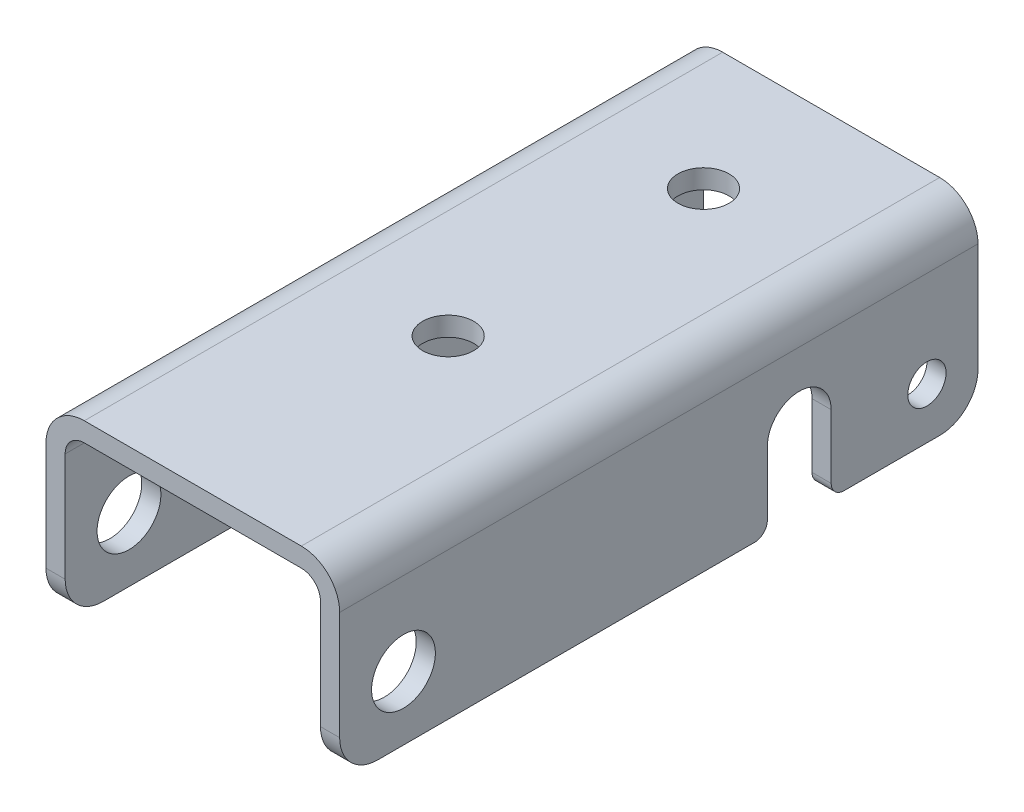
ISO-10303-21;
HEADER;
FILE_DESCRIPTION(('STEP AP214'),'2;1');
FILE_NAME('part.step','',(''),(''),'','','');
FILE_SCHEMA(('AUTOMOTIVE_DESIGN { 1 0 10303 214 1 1 1 1 }'));
ENDSEC;
DATA;
#1=APPLICATION_CONTEXT('core data for automotive mechanical design processes');
#2=APPLICATION_PROTOCOL_DEFINITION('international standard','automotive_design',2000,#1);
#3=PRODUCT_CONTEXT('',#1,'mechanical');
#4=PRODUCT('Part','Part','',(#3));
#5=PRODUCT_RELATED_PRODUCT_CATEGORY('part','',(#4));
#6=PRODUCT_DEFINITION_FORMATION('','',#4);
#7=PRODUCT_DEFINITION_CONTEXT('part definition',#1,'design');
#8=PRODUCT_DEFINITION('design','',#6,#7);
#9=PRODUCT_DEFINITION_SHAPE('','',#8);
#10=(LENGTH_UNIT() NAMED_UNIT(*) SI_UNIT(.MILLI.,.METRE.));
#11=(NAMED_UNIT(*) PLANE_ANGLE_UNIT() SI_UNIT($,.RADIAN.));
#12=(NAMED_UNIT(*) SI_UNIT($,.STERADIAN.) SOLID_ANGLE_UNIT());
#13=UNCERTAINTY_MEASURE_WITH_UNIT(LENGTH_MEASURE(1.E-05),#10,'distance_accuracy_value','');
#14=(GEOMETRIC_REPRESENTATION_CONTEXT(3) GLOBAL_UNCERTAINTY_ASSIGNED_CONTEXT((#13)) GLOBAL_UNIT_ASSIGNED_CONTEXT((#10,
#11,#12)) REPRESENTATION_CONTEXT('',''));
#15=CARTESIAN_POINT('',(0.,0.,0.));
#16=DIRECTION('',(0.,0.,1.));
#17=DIRECTION('',(1.,0.,0.));
#18=AXIS2_PLACEMENT_3D('',#15,#16,#17);
#19=CARTESIAN_POINT('',(10.,0.,25.));
#20=DIRECTION('',(0.,1.,0.));
#21=DIRECTION('',(0.,0.,1.));
#22=AXIS2_PLACEMENT_3D('',#19,#20,#21);
#23=PLANE('',#22);
#24=DIRECTION('',(0.,0.,-1.));
#25=VECTOR('',#24,1.);
#26=CARTESIAN_POINT('',(10.,0.,25.));
#27=LINE('',#26,#25);
#28=CARTESIAN_POINT('',(10.,0.,22.));
#29=VERTEX_POINT('',#28);
#30=CARTESIAN_POINT('',(10.,0.,-7.5));
#31=VERTEX_POINT('',#30);
#32=EDGE_CURVE('E316',#29,#31,#27,.T.);
#33=ORIENTED_EDGE('',*,*,#32,.T.);
#34=DIRECTION('',(1.,0.,0.));
#35=VECTOR('',#34,1.);
#36=CARTESIAN_POINT('',(10.,0.,-7.5));
#37=LINE('',#36,#35);
#38=CARTESIAN_POINT('',(11.5,0.,-7.5));
#39=VERTEX_POINT('',#38);
#40=EDGE_CURVE('E46',#31,#39,#37,.T.);
#41=ORIENTED_EDGE('',*,*,#40,.T.);
#42=DIRECTION('',(0.,0.,-1.));
#43=VECTOR('',#42,1.);
#44=CARTESIAN_POINT('',(11.5,0.,25.));
#45=LINE('',#44,#43);
#46=CARTESIAN_POINT('',(11.5,0.,22.));
#47=VERTEX_POINT('',#46);
#48=EDGE_CURVE('E351',#47,#39,#45,.T.);
#49=ORIENTED_EDGE('',*,*,#48,.F.);
#50=DIRECTION('',(1.,0.,0.));
#51=VECTOR('',#50,1.);
#52=CARTESIAN_POINT('',(10.,0.,22.));
#53=LINE('',#52,#51);
#54=EDGE_CURVE('E372',#47,#29,#53,.F.);
#55=ORIENTED_EDGE('',*,*,#54,.T.);
#56=EDGE_LOOP('',(#33,#41,#49,#55));
#57=FACE_BOUND('',#56,.T.);
#58=ADVANCED_FACE('F37',(#57),#23,.F.);
#59=CARTESIAN_POINT('',(-11.5,0.,25.));
#60=DIRECTION('',(0.,1.,0.));
#61=DIRECTION('',(0.,0.,1.));
#62=AXIS2_PLACEMENT_3D('',#59,#60,#61);
#63=PLANE('',#62);
#64=DIRECTION('',(0.,0.,-1.));
#65=VECTOR('',#64,1.);
#66=CARTESIAN_POINT('',(-11.5,0.,25.));
#67=LINE('',#66,#65);
#68=CARTESIAN_POINT('',(-11.5,0.,22.));
#69=VERTEX_POINT('',#68);
#70=CARTESIAN_POINT('',(-11.5,0.,-7.5));
#71=VERTEX_POINT('',#70);
#72=EDGE_CURVE('E335',#69,#71,#67,.T.);
#73=ORIENTED_EDGE('',*,*,#72,.T.);
#74=DIRECTION('',(1.,0.,0.));
#75=VECTOR('',#74,1.);
#76=CARTESIAN_POINT('',(-11.5,0.,-7.5));
#77=LINE('',#76,#75);
#78=CARTESIAN_POINT('',(-10.,0.,-7.5));
#79=VERTEX_POINT('',#78);
#80=EDGE_CURVE('E410',#71,#79,#77,.T.);
#81=ORIENTED_EDGE('',*,*,#80,.T.);
#82=DIRECTION('',(0.,0.,-1.));
#83=VECTOR('',#82,1.);
#84=CARTESIAN_POINT('',(-10.,0.,25.));
#85=LINE('',#84,#83);
#86=CARTESIAN_POINT('',(-10.,0.,22.));
#87=VERTEX_POINT('',#86);
#88=EDGE_CURVE('E331',#87,#79,#85,.T.);
#89=ORIENTED_EDGE('',*,*,#88,.F.);
#90=DIRECTION('',(1.,0.,0.));
#91=VECTOR('',#90,1.);
#92=CARTESIAN_POINT('',(-11.5,0.,22.));
#93=LINE('',#92,#91);
#94=EDGE_CURVE('E354',#87,#69,#93,.F.);
#95=ORIENTED_EDGE('',*,*,#94,.T.);
#96=EDGE_LOOP('',(#73,#81,#89,#95));
#97=FACE_BOUND('',#96,.T.);
#98=ADVANCED_FACE('F485',(#97),#63,.F.);
#99=CARTESIAN_POINT('',(11.5,0.,-14.5));
#100=VERTEX_POINT('',#99);
#101=CARTESIAN_POINT('',(11.5,0.,-22.));
#102=VERTEX_POINT('',#101);
#103=EDGE_CURVE('E350',#100,#102,#45,.T.);
#104=ORIENTED_EDGE('',*,*,#103,.F.);
#105=DIRECTION('',(1.,0.,0.));
#106=VECTOR('',#105,1.);
#107=CARTESIAN_POINT('',(10.,0.,-14.5));
#108=LINE('',#107,#106);
#109=CARTESIAN_POINT('',(10.,0.,-14.5));
#110=VERTEX_POINT('',#109);
#111=EDGE_CURVE('E422',#100,#110,#108,.F.);
#112=ORIENTED_EDGE('',*,*,#111,.T.);
#113=CARTESIAN_POINT('',(10.,0.,-22.));
#114=VERTEX_POINT('',#113);
#115=EDGE_CURVE('E295',#110,#114,#27,.T.);
#116=ORIENTED_EDGE('',*,*,#115,.T.);
#117=DIRECTION('',(1.,0.,0.));
#118=VECTOR('',#117,1.);
#119=CARTESIAN_POINT('',(10.,0.,-22.));
#120=LINE('',#119,#118);
#121=EDGE_CURVE('E374',#114,#102,#120,.T.);
#122=ORIENTED_EDGE('',*,*,#121,.T.);
#123=EDGE_LOOP('',(#104,#112,#116,#122));
#124=FACE_BOUND('',#123,.T.);
#125=ADVANCED_FACE('F488',(#124),#23,.F.);
#126=CARTESIAN_POINT('',(11.5,0.,25.));
#127=DIRECTION('',(-1.,0.,0.));
#128=DIRECTION('',(0.,0.,1.));
#129=AXIS2_PLACEMENT_3D('',#126,#127,#128);
#130=PLANE('',#129);
#131=CARTESIAN_POINT('',(11.5,4.,-21.));
#132=DIRECTION('',(1.,0.,0.));
#133=DIRECTION('',(0.,0.,-1.));
#134=AXIS2_PLACEMENT_3D('',#131,#132,#133);
#135=CIRCLE('',#134,1.5);
#136=CARTESIAN_POINT('',(11.5,4.,-22.5));
#137=VERTEX_POINT('',#136);
#138=EDGE_CURVE('E443',#137,#137,#135,.T.);
#139=ORIENTED_EDGE('',*,*,#138,.F.);
#140=EDGE_LOOP('',(#139));
#141=FACE_BOUND('',#140,.T.);
#142=CARTESIAN_POINT('',(11.5,5.,20.));
#143=DIRECTION('',(1.,0.,0.));
#144=DIRECTION('',(0.,0.,-1.));
#145=AXIS2_PLACEMENT_3D('',#142,#143,#144);
#146=CIRCLE('',#145,2.5);
#147=CARTESIAN_POINT('',(11.5,5.,17.5));
#148=VERTEX_POINT('',#147);
#149=EDGE_CURVE('E458',#148,#148,#146,.T.);
#150=ORIENTED_EDGE('',*,*,#149,.F.);
#151=EDGE_LOOP('',(#150));
#152=FACE_BOUND('',#151,.T.);
#153=DIRECTION('',(0.,1.,0.));
#154=VECTOR('',#153,1.);
#155=CARTESIAN_POINT('',(11.5,0.,-13.5));
#156=LINE('',#155,#154);
#157=CARTESIAN_POINT('',(11.5,1.,-13.5));
#158=VERTEX_POINT('',#157);
#159=CARTESIAN_POINT('',(11.5,6.,-13.5));
#160=VERTEX_POINT('',#159);
#161=EDGE_CURVE('E258',#158,#160,#156,.T.);
#162=ORIENTED_EDGE('',*,*,#161,.F.);
#163=CARTESIAN_POINT('',(11.5,1.,-14.5));
#164=DIRECTION('',(-1.,0.,0.));
#165=DIRECTION('',(0.,0.,1.));
#166=AXIS2_PLACEMENT_3D('',#163,#164,#165);
#167=CIRCLE('',#166,1.);
#168=EDGE_CURVE('E420',#158,#100,#167,.F.);
#169=ORIENTED_EDGE('',*,*,#168,.T.);
#170=ORIENTED_EDGE('',*,*,#103,.T.);
#171=CARTESIAN_POINT('',(11.5,3.,-22.));
#172=DIRECTION('',(-1.,0.,0.));
#173=DIRECTION('',(0.,0.,1.));
#174=AXIS2_PLACEMENT_3D('',#171,#172,#173);
#175=CIRCLE('',#174,3.);
#176=CARTESIAN_POINT('',(11.5,3.,-25.));
#177=VERTEX_POINT('',#176);
#178=EDGE_CURVE('E379',#102,#177,#175,.F.);
#179=ORIENTED_EDGE('',*,*,#178,.T.);
#180=DIRECTION('',(0.,1.,0.));
#181=VECTOR('',#180,1.);
#182=CARTESIAN_POINT('',(11.5,0.,-25.));
#183=LINE('',#182,#181);
#184=CARTESIAN_POINT('',(11.5,11.5,-25.));
#185=VERTEX_POINT('',#184);
#186=EDGE_CURVE('E271',#177,#185,#183,.T.);
#187=ORIENTED_EDGE('',*,*,#186,.T.);
#188=DIRECTION('',(0.,0.,-1.));
#189=VECTOR('',#188,1.);
#190=CARTESIAN_POINT('',(11.5,11.5,25.));
#191=LINE('',#190,#189);
#192=CARTESIAN_POINT('',(11.5,11.5,25.));
#193=VERTEX_POINT('',#192);
#194=EDGE_CURVE('E347',#193,#185,#191,.T.);
#195=ORIENTED_EDGE('',*,*,#194,.F.);
#196=DIRECTION('',(0.,1.,0.));
#197=VECTOR('',#196,1.);
#198=CARTESIAN_POINT('',(11.5,0.,25.));
#199=LINE('',#198,#197);
#200=CARTESIAN_POINT('',(11.5,3.,25.));
#201=VERTEX_POINT('',#200);
#202=EDGE_CURVE('E272',#201,#193,#199,.T.);
#203=ORIENTED_EDGE('',*,*,#202,.F.);
#204=CARTESIAN_POINT('',(11.5,3.,22.));
#205=DIRECTION('',(-1.,0.,0.));
#206=DIRECTION('',(0.,0.,1.));
#207=AXIS2_PLACEMENT_3D('',#204,#205,#206);
#208=CIRCLE('',#207,3.);
#209=EDGE_CURVE('E377',#201,#47,#208,.F.);
#210=ORIENTED_EDGE('',*,*,#209,.T.);
#211=ORIENTED_EDGE('',*,*,#48,.T.);
#212=CARTESIAN_POINT('',(11.5,1.,-7.5));
#213=DIRECTION('',(-1.,0.,0.));
#214=DIRECTION('',(0.,0.,1.));
#215=AXIS2_PLACEMENT_3D('',#212,#213,#214);
#216=CIRCLE('',#215,1.);
#217=CARTESIAN_POINT('',(11.5,1.,-8.5));
#218=VERTEX_POINT('',#217);
#219=EDGE_CURVE('E418',#39,#218,#216,.F.);
#220=ORIENTED_EDGE('',*,*,#219,.T.);
#221=DIRECTION('',(0.,-1.,0.));
#222=VECTOR('',#221,1.);
#223=CARTESIAN_POINT('',(11.5,0.,-8.5));
#224=LINE('',#223,#222);
#225=CARTESIAN_POINT('',(11.5,6.,-8.5));
#226=VERTEX_POINT('',#225);
#227=EDGE_CURVE('E236',#226,#218,#224,.T.);
#228=ORIENTED_EDGE('',*,*,#227,.F.);
#229=CARTESIAN_POINT('',(11.5,6.,-11.));
#230=DIRECTION('',(1.,0.,0.));
#231=DIRECTION('',(0.,0.,-1.));
#232=AXIS2_PLACEMENT_3D('',#229,#230,#231);
#233=CIRCLE('',#232,2.5);
#234=EDGE_CURVE('E260',#160,#226,#233,.T.);
#235=ORIENTED_EDGE('',*,*,#234,.F.);
#236=EDGE_LOOP('',(#162,#169,#170,#179,#187,#195,#203,#210,#211,#220,#228,#235));
#237=FACE_BOUND('',#236,.T.);
#238=ADVANCED_FACE('F498',(#141,#152,#237),#130,.F.);
#239=CARTESIAN_POINT('',(8.5,11.5,25.));
#240=DIRECTION('',(0.,0.,-1.));
#241=DIRECTION('',(-1.,0.,0.));
#242=AXIS2_PLACEMENT_3D('',#239,#240,#241);
#243=CYLINDRICAL_SURFACE('',#242,3.);
#244=CARTESIAN_POINT('',(8.5,11.5,-25.));
#245=DIRECTION('',(0.,0.,1.));
#246=DIRECTION('',(1.,0.,0.));
#247=AXIS2_PLACEMENT_3D('',#244,#245,#246);
#248=CIRCLE('',#247,3.);
#249=CARTESIAN_POINT('',(8.49999999999998,14.5,-25.));
#250=VERTEX_POINT('',#249);
#251=EDGE_CURVE('E297',#185,#250,#248,.T.);
#252=ORIENTED_EDGE('',*,*,#251,.T.);
#253=DIRECTION('',(0.,0.,-1.));
#254=VECTOR('',#253,1.);
#255=CARTESIAN_POINT('',(8.49999999999998,14.5,25.));
#256=LINE('',#255,#254);
#257=CARTESIAN_POINT('',(8.49999999999998,14.5,25.));
#258=VERTEX_POINT('',#257);
#259=EDGE_CURVE('E344',#258,#250,#256,.T.);
#260=ORIENTED_EDGE('',*,*,#259,.F.);
#261=CARTESIAN_POINT('',(8.5,11.5,25.));
#262=DIRECTION('',(0.,0.,1.));
#263=DIRECTION('',(1.,0.,0.));
#264=AXIS2_PLACEMENT_3D('',#261,#262,#263);
#265=CIRCLE('',#264,3.);
#266=EDGE_CURVE('E274',#193,#258,#265,.T.);
#267=ORIENTED_EDGE('',*,*,#266,.F.);
#268=ORIENTED_EDGE('',*,*,#194,.T.);
#269=EDGE_LOOP('',(#252,#260,#267,#268));
#270=FACE_BOUND('',#269,.T.);
#271=ADVANCED_FACE('F503',(#270),#243,.T.);
#272=CARTESIAN_POINT('',(-8.49999999999998,14.5,25.));
#273=DIRECTION('',(0.,-1.,0.));
#274=DIRECTION('',(0.,0.,-1.));
#275=AXIS2_PLACEMENT_3D('',#272,#273,#274);
#276=PLANE('',#275);
#277=CARTESIAN_POINT('',(0.,14.5,-15.));
#278=DIRECTION('',(0.,1.,0.));
#279=DIRECTION('',(0.,0.,1.));
#280=AXIS2_PLACEMENT_3D('',#277,#278,#279);
#281=CIRCLE('',#280,2.);
#282=CARTESIAN_POINT('',(0.,14.5,-13.));
#283=VERTEX_POINT('',#282);
#284=EDGE_CURVE('E439',#283,#283,#281,.T.);
#285=ORIENTED_EDGE('',*,*,#284,.F.);
#286=EDGE_LOOP('',(#285));
#287=FACE_BOUND('',#286,.T.);
#288=CARTESIAN_POINT('',(0.,14.5,5.));
#289=DIRECTION('',(0.,1.,0.));
#290=DIRECTION('',(0.,0.,1.));
#291=AXIS2_PLACEMENT_3D('',#288,#289,#290);
#292=CIRCLE('',#291,2.);
#293=CARTESIAN_POINT('',(0.,14.5,7.));
#294=VERTEX_POINT('',#293);
#295=EDGE_CURVE('E445',#294,#294,#292,.T.);
#296=ORIENTED_EDGE('',*,*,#295,.F.);
#297=EDGE_LOOP('',(#296));
#298=FACE_BOUND('',#297,.T.);
#299=DIRECTION('',(-1.,0.,0.));
#300=VECTOR('',#299,1.);
#301=CARTESIAN_POINT('',(-8.49999999999998,14.5,-25.));
#302=LINE('',#301,#300);
#303=CARTESIAN_POINT('',(-8.49999999999998,14.5,-25.));
#304=VERTEX_POINT('',#303);
#305=EDGE_CURVE('E299',#250,#304,#302,.T.);
#306=ORIENTED_EDGE('',*,*,#305,.T.);
#307=DIRECTION('',(0.,0.,-1.));
#308=VECTOR('',#307,1.);
#309=CARTESIAN_POINT('',(-8.49999999999998,14.5,25.));
#310=LINE('',#309,#308);
#311=CARTESIAN_POINT('',(-8.49999999999998,14.5,25.));
#312=VERTEX_POINT('',#311);
#313=EDGE_CURVE('E341',#312,#304,#310,.T.);
#314=ORIENTED_EDGE('',*,*,#313,.F.);
#315=DIRECTION('',(-1.,0.,0.));
#316=VECTOR('',#315,1.);
#317=CARTESIAN_POINT('',(-8.49999999999998,14.5,25.));
#318=LINE('',#317,#316);
#319=EDGE_CURVE('E277',#258,#312,#318,.T.);
#320=ORIENTED_EDGE('',*,*,#319,.F.);
#321=ORIENTED_EDGE('',*,*,#259,.T.);
#322=EDGE_LOOP('',(#306,#314,#320,#321));
#323=FACE_BOUND('',#322,.T.);
#324=ADVANCED_FACE('F564',(#287,#298,#323),#276,.F.);
#325=CARTESIAN_POINT('',(-8.5,11.5,25.));
#326=DIRECTION('',(0.,0.,-1.));
#327=DIRECTION('',(-1.,0.,0.));
#328=AXIS2_PLACEMENT_3D('',#325,#326,#327);
#329=CYLINDRICAL_SURFACE('',#328,3.);
#330=CARTESIAN_POINT('',(-8.5,11.5,-25.));
#331=DIRECTION('',(0.,0.,1.));
#332=DIRECTION('',(-1.,0.,0.));
#333=AXIS2_PLACEMENT_3D('',#330,#331,#332);
#334=CIRCLE('',#333,3.);
#335=CARTESIAN_POINT('',(-11.5,11.5,-25.));
#336=VERTEX_POINT('',#335);
#337=EDGE_CURVE('E301',#304,#336,#334,.T.);
#338=ORIENTED_EDGE('',*,*,#337,.T.);
#339=DIRECTION('',(0.,0.,-1.));
#340=VECTOR('',#339,1.);
#341=CARTESIAN_POINT('',(-11.5,11.5,25.));
#342=LINE('',#341,#340);
#343=CARTESIAN_POINT('',(-11.5,11.5,25.));
#344=VERTEX_POINT('',#343);
#345=EDGE_CURVE('E338',#344,#336,#342,.T.);
#346=ORIENTED_EDGE('',*,*,#345,.F.);
#347=CARTESIAN_POINT('',(-8.5,11.5,25.));
#348=DIRECTION('',(0.,0.,1.));
#349=DIRECTION('',(-1.,0.,0.));
#350=AXIS2_PLACEMENT_3D('',#347,#348,#349);
#351=CIRCLE('',#350,3.);
#352=EDGE_CURVE('E279',#312,#344,#351,.T.);
#353=ORIENTED_EDGE('',*,*,#352,.F.);
#354=ORIENTED_EDGE('',*,*,#313,.T.);
#355=EDGE_LOOP('',(#338,#346,#353,#354));
#356=FACE_BOUND('',#355,.T.);
#357=ADVANCED_FACE('F568',(#356),#329,.T.);
#358=CARTESIAN_POINT('',(-11.5,0.,25.));
#359=DIRECTION('',(1.,0.,0.));
#360=DIRECTION('',(0.,0.,-1.));
#361=AXIS2_PLACEMENT_3D('',#358,#359,#360);
#362=PLANE('',#361);
#363=CARTESIAN_POINT('',(-11.5,4.,-21.));
#364=DIRECTION('',(1.,0.,0.));
#365=DIRECTION('',(0.,0.,-1.));
#366=AXIS2_PLACEMENT_3D('',#363,#364,#365);
#367=CIRCLE('',#366,1.5);
#368=CARTESIAN_POINT('',(-11.5,4.,-22.5));
#369=VERTEX_POINT('',#368);
#370=EDGE_CURVE('E436',#369,#369,#367,.T.);
#371=ORIENTED_EDGE('',*,*,#370,.T.);
#372=EDGE_LOOP('',(#371));
#373=FACE_BOUND('',#372,.T.);
#374=CARTESIAN_POINT('',(-11.5,5.,20.));
#375=DIRECTION('',(1.,0.,0.));
#376=DIRECTION('',(0.,0.,-1.));
#377=AXIS2_PLACEMENT_3D('',#374,#375,#376);
#378=CIRCLE('',#377,2.5);
#379=CARTESIAN_POINT('',(-11.5,5.,17.5));
#380=VERTEX_POINT('',#379);
#381=EDGE_CURVE('E432',#380,#380,#378,.T.);
#382=ORIENTED_EDGE('',*,*,#381,.T.);
#383=EDGE_LOOP('',(#382));
#384=FACE_BOUND('',#383,.T.);
#385=CARTESIAN_POINT('',(-11.5,0.,-14.5));
#386=VERTEX_POINT('',#385);
#387=CARTESIAN_POINT('',(-11.5,0.,-22.));
#388=VERTEX_POINT('',#387);
#389=EDGE_CURVE('E334',#386,#388,#67,.T.);
#390=ORIENTED_EDGE('',*,*,#389,.F.);
#391=CARTESIAN_POINT('',(-11.5,1.,-14.5));
#392=DIRECTION('',(1.,0.,0.));
#393=DIRECTION('',(0.,0.,-1.));
#394=AXIS2_PLACEMENT_3D('',#391,#392,#393);
#395=CIRCLE('',#394,1.);
#396=CARTESIAN_POINT('',(-11.5,1.,-13.5));
#397=VERTEX_POINT('',#396);
#398=EDGE_CURVE('E232',#386,#397,#395,.F.);
#399=ORIENTED_EDGE('',*,*,#398,.T.);
#400=DIRECTION('',(0.,1.,0.));
#401=VECTOR('',#400,1.);
#402=CARTESIAN_POINT('',(-11.5,0.,-13.5));
#403=LINE('',#402,#401);
#404=CARTESIAN_POINT('',(-11.5,6.,-13.5));
#405=VERTEX_POINT('',#404);
#406=EDGE_CURVE('E224',#397,#405,#403,.T.);
#407=ORIENTED_EDGE('',*,*,#406,.T.);
#408=CARTESIAN_POINT('',(-11.5,6.,-11.));
#409=DIRECTION('',(1.,0.,0.));
#410=DIRECTION('',(0.,0.,-1.));
#411=AXIS2_PLACEMENT_3D('',#408,#409,#410);
#412=CIRCLE('',#411,2.5);
#413=CARTESIAN_POINT('',(-11.5,6.,-8.5));
#414=VERTEX_POINT('',#413);
#415=EDGE_CURVE('E230',#405,#414,#412,.T.);
#416=ORIENTED_EDGE('',*,*,#415,.T.);
#417=DIRECTION('',(0.,-1.,0.));
#418=VECTOR('',#417,1.);
#419=CARTESIAN_POINT('',(-11.5,0.,-8.5));
#420=LINE('',#419,#418);
#421=CARTESIAN_POINT('',(-11.5,1.,-8.5));
#422=VERTEX_POINT('',#421);
#423=EDGE_CURVE('E253',#414,#422,#420,.T.);
#424=ORIENTED_EDGE('',*,*,#423,.T.);
#425=CARTESIAN_POINT('',(-11.5,1.,-7.5));
#426=DIRECTION('',(1.,0.,0.));
#427=DIRECTION('',(0.,0.,-1.));
#428=AXIS2_PLACEMENT_3D('',#425,#426,#427);
#429=CIRCLE('',#428,1.);
#430=EDGE_CURVE('E407',#422,#71,#429,.F.);
#431=ORIENTED_EDGE('',*,*,#430,.T.);
#432=ORIENTED_EDGE('',*,*,#72,.F.);
#433=CARTESIAN_POINT('',(-11.5,3.,22.));
#434=DIRECTION('',(1.,0.,0.));
#435=DIRECTION('',(0.,0.,-1.));
#436=AXIS2_PLACEMENT_3D('',#433,#434,#435);
#437=CIRCLE('',#436,3.);
#438=CARTESIAN_POINT('',(-11.5,3.,25.));
#439=VERTEX_POINT('',#438);
#440=EDGE_CURVE('E367',#69,#439,#437,.F.);
#441=ORIENTED_EDGE('',*,*,#440,.T.);
#442=DIRECTION('',(0.,-1.,0.));
#443=VECTOR('',#442,1.);
#444=CARTESIAN_POINT('',(-11.5,0.,25.));
#445=LINE('',#444,#443);
#446=EDGE_CURVE('E281',#344,#439,#445,.T.);
#447=ORIENTED_EDGE('',*,*,#446,.F.);
#448=ORIENTED_EDGE('',*,*,#345,.T.);
#449=DIRECTION('',(0.,-1.,0.));
#450=VECTOR('',#449,1.);
#451=CARTESIAN_POINT('',(-11.5,0.,-25.));
#452=LINE('',#451,#450);
#453=CARTESIAN_POINT('',(-11.5,3.,-25.));
#454=VERTEX_POINT('',#453);
#455=EDGE_CURVE('E303',#336,#454,#452,.T.);
#456=ORIENTED_EDGE('',*,*,#455,.T.);
#457=CARTESIAN_POINT('',(-11.5,3.,-22.));
#458=DIRECTION('',(1.,0.,0.));
#459=DIRECTION('',(0.,0.,-1.));
#460=AXIS2_PLACEMENT_3D('',#457,#458,#459);
#461=CIRCLE('',#460,3.);
#462=EDGE_CURVE('E369',#454,#388,#461,.F.);
#463=ORIENTED_EDGE('',*,*,#462,.T.);
#464=EDGE_LOOP('',(#390,#399,#407,#416,#424,#431,#432,#441,#447,#448,#456,#463));
#465=FACE_BOUND('',#464,.T.);
#466=ADVANCED_FACE('F227',(#373,#384,#465),#362,.F.);
#467=CARTESIAN_POINT('',(-10.,0.,-14.5));
#468=VERTEX_POINT('',#467);
#469=CARTESIAN_POINT('',(-10.,0.,-22.));
#470=VERTEX_POINT('',#469);
#471=EDGE_CURVE('E330',#468,#470,#85,.T.);
#472=ORIENTED_EDGE('',*,*,#471,.F.);
#473=DIRECTION('',(1.,0.,0.));
#474=VECTOR('',#473,1.);
#475=CARTESIAN_POINT('',(-11.5,0.,-14.5));
#476=LINE('',#475,#474);
#477=EDGE_CURVE('E405',#468,#386,#476,.F.);
#478=ORIENTED_EDGE('',*,*,#477,.T.);
#479=ORIENTED_EDGE('',*,*,#389,.T.);
#480=DIRECTION('',(1.,0.,0.));
#481=VECTOR('',#480,1.);
#482=CARTESIAN_POINT('',(-11.5,0.,-22.));
#483=LINE('',#482,#481);
#484=EDGE_CURVE('E356',#388,#470,#483,.T.);
#485=ORIENTED_EDGE('',*,*,#484,.T.);
#486=EDGE_LOOP('',(#472,#478,#479,#485));
#487=FACE_BOUND('',#486,.T.);
#488=ADVANCED_FACE('F494',(#487),#63,.F.);
#489=CARTESIAN_POINT('',(-10.,0.,25.));
#490=DIRECTION('',(-1.,0.,0.));
#491=DIRECTION('',(0.,0.,1.));
#492=AXIS2_PLACEMENT_3D('',#489,#490,#491);
#493=PLANE('',#492);
#494=CARTESIAN_POINT('',(-10.,4.,-21.));
#495=DIRECTION('',(-1.,0.,0.));
#496=DIRECTION('',(0.,0.,1.));
#497=AXIS2_PLACEMENT_3D('',#494,#495,#496);
#498=CIRCLE('',#497,1.5);
#499=CARTESIAN_POINT('',(-10.,4.,-19.5));
#500=VERTEX_POINT('',#499);
#501=EDGE_CURVE('E435',#500,#500,#498,.T.);
#502=ORIENTED_EDGE('',*,*,#501,.T.);
#503=EDGE_LOOP('',(#502));
#504=FACE_BOUND('',#503,.T.);
#505=CARTESIAN_POINT('',(-10.,5.,20.));
#506=DIRECTION('',(-1.,0.,0.));
#507=DIRECTION('',(0.,0.,1.));
#508=AXIS2_PLACEMENT_3D('',#505,#506,#507);
#509=CIRCLE('',#508,2.5);
#510=CARTESIAN_POINT('',(-10.,5.,22.5));
#511=VERTEX_POINT('',#510);
#512=EDGE_CURVE('E261',#511,#511,#509,.T.);
#513=ORIENTED_EDGE('',*,*,#512,.T.);
#514=EDGE_LOOP('',(#513));
#515=FACE_BOUND('',#514,.T.);
#516=DIRECTION('',(0.,-1.,0.));
#517=VECTOR('',#516,1.);
#518=CARTESIAN_POINT('',(-10.,0.,-13.5));
#519=LINE('',#518,#517);
#520=CARTESIAN_POINT('',(-10.,6.,-13.5));
#521=VERTEX_POINT('',#520);
#522=CARTESIAN_POINT('',(-10.,1.,-13.5));
#523=VERTEX_POINT('',#522);
#524=EDGE_CURVE('E242',#521,#523,#519,.T.);
#525=ORIENTED_EDGE('',*,*,#524,.T.);
#526=CARTESIAN_POINT('',(-10.,1.,-14.5));
#527=DIRECTION('',(-1.,0.,0.));
#528=DIRECTION('',(0.,0.,1.));
#529=AXIS2_PLACEMENT_3D('',#526,#527,#528);
#530=CIRCLE('',#529,1.);
#531=EDGE_CURVE('E403',#523,#468,#530,.F.);
#532=ORIENTED_EDGE('',*,*,#531,.T.);
#533=ORIENTED_EDGE('',*,*,#471,.T.);
#534=CARTESIAN_POINT('',(-10.,3.,-22.));
#535=DIRECTION('',(-1.,0.,0.));
#536=DIRECTION('',(0.,0.,1.));
#537=AXIS2_PLACEMENT_3D('',#534,#535,#536);
#538=CIRCLE('',#537,3.);
#539=CARTESIAN_POINT('',(-10.,3.,-25.));
#540=VERTEX_POINT('',#539);
#541=EDGE_CURVE('E361',#470,#540,#538,.F.);
#542=ORIENTED_EDGE('',*,*,#541,.T.);
#543=DIRECTION('',(0.,1.,0.));
#544=VECTOR('',#543,1.);
#545=CARTESIAN_POINT('',(-10.,0.,-25.));
#546=LINE('',#545,#544);
#547=CARTESIAN_POINT('',(-10.,11.5,-25.));
#548=VERTEX_POINT('',#547);
#549=EDGE_CURVE('E306',#540,#548,#546,.T.);
#550=ORIENTED_EDGE('',*,*,#549,.T.);
#551=DIRECTION('',(0.,0.,-1.));
#552=VECTOR('',#551,1.);
#553=CARTESIAN_POINT('',(-10.,11.5,25.));
#554=LINE('',#553,#552);
#555=CARTESIAN_POINT('',(-10.,11.5,25.));
#556=VERTEX_POINT('',#555);
#557=EDGE_CURVE('E327',#556,#548,#554,.T.);
#558=ORIENTED_EDGE('',*,*,#557,.F.);
#559=DIRECTION('',(0.,1.,0.));
#560=VECTOR('',#559,1.);
#561=CARTESIAN_POINT('',(-10.,0.,25.));
#562=LINE('',#561,#560);
#563=CARTESIAN_POINT('',(-10.,3.,25.));
#564=VERTEX_POINT('',#563);
#565=EDGE_CURVE('E284',#564,#556,#562,.T.);
#566=ORIENTED_EDGE('',*,*,#565,.F.);
#567=CARTESIAN_POINT('',(-10.,3.,22.));
#568=DIRECTION('',(-1.,0.,0.));
#569=DIRECTION('',(0.,0.,1.));
#570=AXIS2_PLACEMENT_3D('',#567,#568,#569);
#571=CIRCLE('',#570,3.);
#572=EDGE_CURVE('E359',#564,#87,#571,.F.);
#573=ORIENTED_EDGE('',*,*,#572,.T.);
#574=ORIENTED_EDGE('',*,*,#88,.T.);
#575=CARTESIAN_POINT('',(-10.,1.,-7.5));
#576=DIRECTION('',(-1.,0.,0.));
#577=DIRECTION('',(0.,0.,1.));
#578=AXIS2_PLACEMENT_3D('',#575,#576,#577);
#579=CIRCLE('',#578,1.);
#580=CARTESIAN_POINT('',(-10.,1.,-8.5));
#581=VERTEX_POINT('',#580);
#582=EDGE_CURVE('E401',#79,#581,#579,.F.);
#583=ORIENTED_EDGE('',*,*,#582,.T.);
#584=DIRECTION('',(0.,1.,0.));
#585=VECTOR('',#584,1.);
#586=CARTESIAN_POINT('',(-10.,0.,-8.5));
#587=LINE('',#586,#585);
#588=CARTESIAN_POINT('',(-10.,6.,-8.5));
#589=VERTEX_POINT('',#588);
#590=EDGE_CURVE('E269',#581,#589,#587,.T.);
#591=ORIENTED_EDGE('',*,*,#590,.T.);
#592=CARTESIAN_POINT('',(-10.,6.,-11.));
#593=DIRECTION('',(-1.,0.,0.));
#594=DIRECTION('',(0.,0.,1.));
#595=AXIS2_PLACEMENT_3D('',#592,#593,#594);
#596=CIRCLE('',#595,2.5);
#597=EDGE_CURVE('E267',#589,#521,#596,.T.);
#598=ORIENTED_EDGE('',*,*,#597,.T.);
#599=EDGE_LOOP('',(#525,#532,#533,#542,#550,#558,#566,#573,#574,#583,#591,#598));
#600=FACE_BOUND('',#599,.T.);
#601=ADVANCED_FACE('F465',(#504,#515,#600),#493,.F.);
#602=CARTESIAN_POINT('',(-8.5,11.5,25.));
#603=DIRECTION('',(0.,0.,-1.));
#604=DIRECTION('',(-1.,0.,0.));
#605=AXIS2_PLACEMENT_3D('',#602,#603,#604);
#606=CYLINDRICAL_SURFACE('',#605,1.5);
#607=CARTESIAN_POINT('',(-8.5,11.5,-25.));
#608=DIRECTION('',(0.,0.,-1.));
#609=DIRECTION('',(-1.,0.,0.));
#610=AXIS2_PLACEMENT_3D('',#607,#608,#609);
#611=CIRCLE('',#610,1.5);
#612=CARTESIAN_POINT('',(-8.49999999999999,13.,-25.));
#613=VERTEX_POINT('',#612);
#614=EDGE_CURVE('E308',#548,#613,#611,.T.);
#615=ORIENTED_EDGE('',*,*,#614,.T.);
#616=DIRECTION('',(0.,0.,-1.));
#617=VECTOR('',#616,1.);
#618=CARTESIAN_POINT('',(-8.49999999999999,13.,25.));
#619=LINE('',#618,#617);
#620=CARTESIAN_POINT('',(-8.49999999999999,13.,25.));
#621=VERTEX_POINT('',#620);
#622=EDGE_CURVE('E324',#621,#613,#619,.T.);
#623=ORIENTED_EDGE('',*,*,#622,.F.);
#624=CARTESIAN_POINT('',(-8.5,11.5,25.));
#625=DIRECTION('',(0.,0.,-1.));
#626=DIRECTION('',(-1.,0.,0.));
#627=AXIS2_PLACEMENT_3D('',#624,#625,#626);
#628=CIRCLE('',#627,1.5);
#629=EDGE_CURVE('E286',#556,#621,#628,.T.);
#630=ORIENTED_EDGE('',*,*,#629,.F.);
#631=ORIENTED_EDGE('',*,*,#557,.T.);
#632=EDGE_LOOP('',(#615,#623,#630,#631));
#633=FACE_BOUND('',#632,.T.);
#634=ADVANCED_FACE('F613',(#633),#606,.F.);
#635=CARTESIAN_POINT('',(-8.49999999999999,13.,25.));
#636=DIRECTION('',(0.,1.,0.));
#637=DIRECTION('',(-1.,0.,0.));
#638=AXIS2_PLACEMENT_3D('',#635,#636,#637);
#639=PLANE('',#638);
#640=CARTESIAN_POINT('',(0.,13.,-15.));
#641=DIRECTION('',(0.,1.,0.));
#642=DIRECTION('',(-1.,0.,0.));
#643=AXIS2_PLACEMENT_3D('',#640,#641,#642);
#644=CIRCLE('',#643,2.);
#645=CARTESIAN_POINT('',(-2.,13.,-15.));
#646=VERTEX_POINT('',#645);
#647=EDGE_CURVE('E41',#646,#646,#644,.T.);
#648=ORIENTED_EDGE('',*,*,#647,.T.);
#649=EDGE_LOOP('',(#648));
#650=FACE_BOUND('',#649,.T.);
#651=CARTESIAN_POINT('',(0.,13.,5.));
#652=DIRECTION('',(0.,1.,0.));
#653=DIRECTION('',(-1.,0.,0.));
#654=AXIS2_PLACEMENT_3D('',#651,#652,#653);
#655=CIRCLE('',#654,2.);
#656=CARTESIAN_POINT('',(-2.,13.,5.));
#657=VERTEX_POINT('',#656);
#658=EDGE_CURVE('E437',#657,#657,#655,.T.);
#659=ORIENTED_EDGE('',*,*,#658,.T.);
#660=EDGE_LOOP('',(#659));
#661=FACE_BOUND('',#660,.T.);
#662=DIRECTION('',(1.,0.,0.));
#663=VECTOR('',#662,1.);
#664=CARTESIAN_POINT('',(-8.49999999999999,13.,-25.));
#665=LINE('',#664,#663);
#666=CARTESIAN_POINT('',(8.49999999999998,13.,-25.));
#667=VERTEX_POINT('',#666);
#668=EDGE_CURVE('E310',#613,#667,#665,.T.);
#669=ORIENTED_EDGE('',*,*,#668,.T.);
#670=DIRECTION('',(0.,0.,-1.));
#671=VECTOR('',#670,1.);
#672=CARTESIAN_POINT('',(8.49999999999998,13.,25.));
#673=LINE('',#672,#671);
#674=CARTESIAN_POINT('',(8.49999999999998,13.,25.));
#675=VERTEX_POINT('',#674);
#676=EDGE_CURVE('E321',#675,#667,#673,.T.);
#677=ORIENTED_EDGE('',*,*,#676,.F.);
#678=DIRECTION('',(1.,0.,0.));
#679=VECTOR('',#678,1.);
#680=CARTESIAN_POINT('',(-8.49999999999999,13.,25.));
#681=LINE('',#680,#679);
#682=EDGE_CURVE('E288',#621,#675,#681,.T.);
#683=ORIENTED_EDGE('',*,*,#682,.F.);
#684=ORIENTED_EDGE('',*,*,#622,.T.);
#685=EDGE_LOOP('',(#669,#677,#683,#684));
#686=FACE_BOUND('',#685,.T.);
#687=ADVANCED_FACE('F610',(#650,#661,#686),#639,.F.);
#688=CARTESIAN_POINT('',(8.5,11.5,25.));
#689=DIRECTION('',(0.,0.,-1.));
#690=DIRECTION('',(-1.,0.,0.));
#691=AXIS2_PLACEMENT_3D('',#688,#689,#690);
#692=CYLINDRICAL_SURFACE('',#691,1.5);
#693=CARTESIAN_POINT('',(8.5,11.5,-25.));
#694=DIRECTION('',(0.,0.,-1.));
#695=DIRECTION('',(1.,0.,0.));
#696=AXIS2_PLACEMENT_3D('',#693,#694,#695);
#697=CIRCLE('',#696,1.5);
#698=CARTESIAN_POINT('',(10.,11.5,-25.));
#699=VERTEX_POINT('',#698);
#700=EDGE_CURVE('E312',#667,#699,#697,.T.);
#701=ORIENTED_EDGE('',*,*,#700,.T.);
#702=DIRECTION('',(0.,0.,-1.));
#703=VECTOR('',#702,1.);
#704=CARTESIAN_POINT('',(10.,11.5,25.));
#705=LINE('',#704,#703);
#706=CARTESIAN_POINT('',(10.,11.5,25.));
#707=VERTEX_POINT('',#706);
#708=EDGE_CURVE('E318',#707,#699,#705,.T.);
#709=ORIENTED_EDGE('',*,*,#708,.F.);
#710=CARTESIAN_POINT('',(8.5,11.5,25.));
#711=DIRECTION('',(0.,0.,-1.));
#712=DIRECTION('',(1.,0.,0.));
#713=AXIS2_PLACEMENT_3D('',#710,#711,#712);
#714=CIRCLE('',#713,1.5);
#715=EDGE_CURVE('E290',#675,#707,#714,.T.);
#716=ORIENTED_EDGE('',*,*,#715,.F.);
#717=ORIENTED_EDGE('',*,*,#676,.T.);
#718=EDGE_LOOP('',(#701,#709,#716,#717));
#719=FACE_BOUND('',#718,.T.);
#720=ADVANCED_FACE('F606',(#719),#692,.F.);
#721=CARTESIAN_POINT('',(10.,0.,25.));
#722=DIRECTION('',(1.,0.,0.));
#723=DIRECTION('',(0.,0.,-1.));
#724=AXIS2_PLACEMENT_3D('',#721,#722,#723);
#725=PLANE('',#724);
#726=CARTESIAN_POINT('',(10.,4.,-21.));
#727=DIRECTION('',(1.,0.,0.));
#728=DIRECTION('',(0.,0.,-1.));
#729=AXIS2_PLACEMENT_3D('',#726,#727,#728);
#730=CIRCLE('',#729,1.5);
#731=CARTESIAN_POINT('',(10.,4.,-22.5));
#732=VERTEX_POINT('',#731);
#733=EDGE_CURVE('E433',#732,#732,#730,.T.);
#734=ORIENTED_EDGE('',*,*,#733,.T.);
#735=EDGE_LOOP('',(#734));
#736=FACE_BOUND('',#735,.T.);
#737=CARTESIAN_POINT('',(10.,5.,20.));
#738=DIRECTION('',(1.,0.,0.));
#739=DIRECTION('',(0.,0.,-1.));
#740=AXIS2_PLACEMENT_3D('',#737,#738,#739);
#741=CIRCLE('',#740,2.5);
#742=CARTESIAN_POINT('',(10.,5.,17.5));
#743=VERTEX_POINT('',#742);
#744=EDGE_CURVE('E429',#743,#743,#741,.T.);
#745=ORIENTED_EDGE('',*,*,#744,.T.);
#746=EDGE_LOOP('',(#745));
#747=FACE_BOUND('',#746,.T.);
#748=ORIENTED_EDGE('',*,*,#115,.F.);
#749=CARTESIAN_POINT('',(10.,1.,-14.5));
#750=DIRECTION('',(1.,0.,0.));
#751=DIRECTION('',(0.,0.,-1.));
#752=AXIS2_PLACEMENT_3D('',#749,#750,#751);
#753=CIRCLE('',#752,1.);
#754=CARTESIAN_POINT('',(10.,1.,-13.5));
#755=VERTEX_POINT('',#754);
#756=EDGE_CURVE('E425',#110,#755,#753,.F.);
#757=ORIENTED_EDGE('',*,*,#756,.T.);
#758=DIRECTION('',(0.,1.,0.));
#759=VECTOR('',#758,1.);
#760=CARTESIAN_POINT('',(10.,0.,-13.5));
#761=LINE('',#760,#759);
#762=CARTESIAN_POINT('',(10.,6.,-13.5));
#763=VERTEX_POINT('',#762);
#764=EDGE_CURVE('E392',#755,#763,#761,.T.);
#765=ORIENTED_EDGE('',*,*,#764,.T.);
#766=CARTESIAN_POINT('',(10.,6.,-11.));
#767=DIRECTION('',(1.,0.,0.));
#768=DIRECTION('',(0.,0.,-1.));
#769=AXIS2_PLACEMENT_3D('',#766,#767,#768);
#770=CIRCLE('',#769,2.5);
#771=CARTESIAN_POINT('',(10.,6.,-8.5));
#772=VERTEX_POINT('',#771);
#773=EDGE_CURVE('E394',#763,#772,#770,.T.);
#774=ORIENTED_EDGE('',*,*,#773,.T.);
#775=DIRECTION('',(0.,-1.,0.));
#776=VECTOR('',#775,1.);
#777=CARTESIAN_POINT('',(10.,0.,-8.5));
#778=LINE('',#777,#776);
#779=CARTESIAN_POINT('',(10.,1.,-8.5));
#780=VERTEX_POINT('',#779);
#781=EDGE_CURVE('E397',#772,#780,#778,.T.);
#782=ORIENTED_EDGE('',*,*,#781,.T.);
#783=CARTESIAN_POINT('',(10.,1.,-7.5));
#784=DIRECTION('',(1.,0.,0.));
#785=DIRECTION('',(0.,0.,-1.));
#786=AXIS2_PLACEMENT_3D('',#783,#784,#785);
#787=CIRCLE('',#786,1.);
#788=EDGE_CURVE('E54',#780,#31,#787,.F.);
#789=ORIENTED_EDGE('',*,*,#788,.T.);
#790=ORIENTED_EDGE('',*,*,#32,.F.);
#791=CARTESIAN_POINT('',(10.,3.,22.));
#792=DIRECTION('',(1.,0.,0.));
#793=DIRECTION('',(0.,0.,-1.));
#794=AXIS2_PLACEMENT_3D('',#791,#792,#793);
#795=CIRCLE('',#794,3.);
#796=CARTESIAN_POINT('',(10.,3.,25.));
#797=VERTEX_POINT('',#796);
#798=EDGE_CURVE('E381',#29,#797,#795,.F.);
#799=ORIENTED_EDGE('',*,*,#798,.T.);
#800=DIRECTION('',(0.,-1.,0.));
#801=VECTOR('',#800,1.);
#802=CARTESIAN_POINT('',(10.,0.,25.));
#803=LINE('',#802,#801);
#804=EDGE_CURVE('E292',#707,#797,#803,.T.);
#805=ORIENTED_EDGE('',*,*,#804,.F.);
#806=ORIENTED_EDGE('',*,*,#708,.T.);
#807=DIRECTION('',(0.,-1.,0.));
#808=VECTOR('',#807,1.);
#809=CARTESIAN_POINT('',(10.,0.,-25.));
#810=LINE('',#809,#808);
#811=CARTESIAN_POINT('',(10.,3.,-25.));
#812=VERTEX_POINT('',#811);
#813=EDGE_CURVE('E275',#699,#812,#810,.T.);
#814=ORIENTED_EDGE('',*,*,#813,.T.);
#815=CARTESIAN_POINT('',(10.,3.,-22.));
#816=DIRECTION('',(1.,0.,0.));
#817=DIRECTION('',(0.,0.,-1.));
#818=AXIS2_PLACEMENT_3D('',#815,#816,#817);
#819=CIRCLE('',#818,3.);
#820=EDGE_CURVE('E383',#812,#114,#819,.F.);
#821=ORIENTED_EDGE('',*,*,#820,.T.);
#822=EDGE_LOOP('',(#748,#757,#765,#774,#782,#789,#790,#799,#805,#806,#814,#821));
#823=FACE_BOUND('',#822,.T.);
#824=ADVANCED_FACE('F516',(#736,#747,#823),#725,.F.);
#825=CARTESIAN_POINT('',(8.5,11.5,25.));
#826=DIRECTION('',(0.,0.,1.));
#827=DIRECTION('',(1.,0.,0.));
#828=AXIS2_PLACEMENT_3D('',#825,#826,#827);
#829=PLANE('',#828);
#830=ORIENTED_EDGE('',*,*,#804,.T.);
#831=DIRECTION('',(1.,0.,0.));
#832=VECTOR('',#831,1.);
#833=CARTESIAN_POINT('',(11.5,3.,25.));
#834=LINE('',#833,#832);
#835=EDGE_CURVE('E389',#797,#201,#834,.T.);
#836=ORIENTED_EDGE('',*,*,#835,.T.);
#837=ORIENTED_EDGE('',*,*,#202,.T.);
#838=ORIENTED_EDGE('',*,*,#266,.T.);
#839=ORIENTED_EDGE('',*,*,#319,.T.);
#840=ORIENTED_EDGE('',*,*,#352,.T.);
#841=ORIENTED_EDGE('',*,*,#446,.T.);
#842=DIRECTION('',(1.,0.,0.));
#843=VECTOR('',#842,1.);
#844=CARTESIAN_POINT('',(-10.,3.,25.));
#845=LINE('',#844,#843);
#846=EDGE_CURVE('E386',#439,#564,#845,.T.);
#847=ORIENTED_EDGE('',*,*,#846,.T.);
#848=ORIENTED_EDGE('',*,*,#565,.T.);
#849=ORIENTED_EDGE('',*,*,#629,.T.);
#850=ORIENTED_EDGE('',*,*,#682,.T.);
#851=ORIENTED_EDGE('',*,*,#715,.T.);
#852=EDGE_LOOP('',(#830,#836,#837,#838,#839,#840,#841,#847,#848,#849,#850,#851));
#853=FACE_BOUND('',#852,.T.);
#854=ADVANCED_FACE('F539',(#853),#829,.T.);
#855=CARTESIAN_POINT('',(8.5,11.5,-25.));
#856=DIRECTION('',(0.,0.,1.));
#857=DIRECTION('',(1.,0.,0.));
#858=AXIS2_PLACEMENT_3D('',#855,#856,#857);
#859=PLANE('',#858);
#860=ORIENTED_EDGE('',*,*,#549,.F.);
#861=DIRECTION('',(1.,0.,0.));
#862=VECTOR('',#861,1.);
#863=CARTESIAN_POINT('',(8.5,3.,-25.));
#864=LINE('',#863,#862);
#865=EDGE_CURVE('E365',#540,#454,#864,.F.);
#866=ORIENTED_EDGE('',*,*,#865,.T.);
#867=ORIENTED_EDGE('',*,*,#455,.F.);
#868=ORIENTED_EDGE('',*,*,#337,.F.);
#869=ORIENTED_EDGE('',*,*,#305,.F.);
#870=ORIENTED_EDGE('',*,*,#251,.F.);
#871=ORIENTED_EDGE('',*,*,#186,.F.);
#872=DIRECTION('',(1.,0.,0.));
#873=VECTOR('',#872,1.);
#874=CARTESIAN_POINT('',(8.5,3.,-25.));
#875=LINE('',#874,#873);
#876=EDGE_CURVE('E363',#177,#812,#875,.F.);
#877=ORIENTED_EDGE('',*,*,#876,.T.);
#878=ORIENTED_EDGE('',*,*,#813,.F.);
#879=ORIENTED_EDGE('',*,*,#700,.F.);
#880=ORIENTED_EDGE('',*,*,#668,.F.);
#881=ORIENTED_EDGE('',*,*,#614,.F.);
#882=EDGE_LOOP('',(#860,#866,#867,#868,#869,#870,#871,#877,#878,#879,#880,#881));
#883=FACE_BOUND('',#882,.T.);
#884=ADVANCED_FACE('F549',(#883),#859,.F.);
#885=CARTESIAN_POINT('',(-11.5,3.,-22.));
#886=DIRECTION('',(1.,0.,0.));
#887=DIRECTION('',(0.,0.,-1.));
#888=AXIS2_PLACEMENT_3D('',#885,#886,#887);
#889=CYLINDRICAL_SURFACE('',#888,3.);
#890=ORIENTED_EDGE('',*,*,#462,.F.);
#891=ORIENTED_EDGE('',*,*,#865,.F.);
#892=ORIENTED_EDGE('',*,*,#541,.F.);
#893=ORIENTED_EDGE('',*,*,#484,.F.);
#894=EDGE_LOOP('',(#890,#891,#892,#893));
#895=FACE_BOUND('',#894,.T.);
#896=ADVANCED_FACE('F603',(#895),#889,.T.);
#897=CARTESIAN_POINT('',(10.,3.,-22.));
#898=DIRECTION('',(1.,0.,0.));
#899=DIRECTION('',(0.,0.,-1.));
#900=AXIS2_PLACEMENT_3D('',#897,#898,#899);
#901=CYLINDRICAL_SURFACE('',#900,3.);
#902=ORIENTED_EDGE('',*,*,#820,.F.);
#903=ORIENTED_EDGE('',*,*,#876,.F.);
#904=ORIENTED_EDGE('',*,*,#178,.F.);
#905=ORIENTED_EDGE('',*,*,#121,.F.);
#906=EDGE_LOOP('',(#902,#903,#904,#905));
#907=FACE_BOUND('',#906,.T.);
#908=ADVANCED_FACE('F555',(#907),#901,.T.);
#909=CARTESIAN_POINT('',(8.5,3.,22.));
#910=DIRECTION('',(-1.,0.,0.));
#911=DIRECTION('',(0.,0.,1.));
#912=AXIS2_PLACEMENT_3D('',#909,#910,#911);
#913=CYLINDRICAL_SURFACE('',#912,3.);
#914=ORIENTED_EDGE('',*,*,#798,.F.);
#915=ORIENTED_EDGE('',*,*,#54,.F.);
#916=ORIENTED_EDGE('',*,*,#209,.F.);
#917=ORIENTED_EDGE('',*,*,#835,.F.);
#918=EDGE_LOOP('',(#914,#915,#916,#917));
#919=FACE_BOUND('',#918,.T.);
#920=ADVANCED_FACE('F537',(#919),#913,.T.);
#921=CARTESIAN_POINT('',(8.5,3.,22.));
#922=DIRECTION('',(-1.,0.,0.));
#923=DIRECTION('',(0.,0.,1.));
#924=AXIS2_PLACEMENT_3D('',#921,#922,#923);
#925=CYLINDRICAL_SURFACE('',#924,3.);
#926=ORIENTED_EDGE('',*,*,#440,.F.);
#927=ORIENTED_EDGE('',*,*,#94,.F.);
#928=ORIENTED_EDGE('',*,*,#572,.F.);
#929=ORIENTED_EDGE('',*,*,#846,.F.);
#930=EDGE_LOOP('',(#926,#927,#928,#929));
#931=FACE_BOUND('',#930,.T.);
#932=ADVANCED_FACE('F575',(#931),#925,.T.);
#933=CARTESIAN_POINT('',(-11.5,0.,-13.5));
#934=DIRECTION('',(0.,0.,-1.));
#935=DIRECTION('',(-1.,0.,0.));
#936=AXIS2_PLACEMENT_3D('',#933,#934,#935);
#937=PLANE('',#936);
#938=ORIENTED_EDGE('',*,*,#764,.F.);
#939=DIRECTION('',(1.,0.,0.));
#940=VECTOR('',#939,1.);
#941=CARTESIAN_POINT('',(-11.5,1.,-13.5));
#942=LINE('',#941,#940);
#943=EDGE_CURVE('E415',#755,#158,#942,.T.);
#944=ORIENTED_EDGE('',*,*,#943,.T.);
#945=ORIENTED_EDGE('',*,*,#161,.T.);
#946=DIRECTION('',(1.,0.,0.));
#947=VECTOR('',#946,1.);
#948=CARTESIAN_POINT('',(-11.5,6.,-13.5));
#949=LINE('',#948,#947);
#950=EDGE_CURVE('E247',#763,#160,#949,.T.);
#951=ORIENTED_EDGE('',*,*,#950,.F.);
#952=EDGE_LOOP('',(#938,#944,#945,#951));
#953=FACE_BOUND('',#952,.T.);
#954=ADVANCED_FACE('F519',(#953),#937,.F.);
#955=CARTESIAN_POINT('',(-11.5,6.,-11.));
#956=DIRECTION('',(1.,0.,0.));
#957=DIRECTION('',(0.,0.,-1.));
#958=AXIS2_PLACEMENT_3D('',#955,#956,#957);
#959=CYLINDRICAL_SURFACE('',#958,2.5);
#960=ORIENTED_EDGE('',*,*,#950,.T.);
#961=ORIENTED_EDGE('',*,*,#234,.T.);
#962=DIRECTION('',(1.,0.,0.));
#963=VECTOR('',#962,1.);
#964=CARTESIAN_POINT('',(-11.5,6.,-8.5));
#965=LINE('',#964,#963);
#966=EDGE_CURVE('E246',#772,#226,#965,.T.);
#967=ORIENTED_EDGE('',*,*,#966,.F.);
#968=ORIENTED_EDGE('',*,*,#773,.F.);
#969=EDGE_LOOP('',(#960,#961,#967,#968));
#970=FACE_BOUND('',#969,.T.);
#971=ADVANCED_FACE('F526',(#970),#959,.F.);
#972=CARTESIAN_POINT('',(-11.5,0.,-8.5));
#973=DIRECTION('',(0.,0.,1.));
#974=DIRECTION('',(1.,0.,0.));
#975=AXIS2_PLACEMENT_3D('',#972,#973,#974);
#976=PLANE('',#975);
#977=ORIENTED_EDGE('',*,*,#227,.T.);
#978=DIRECTION('',(1.,0.,0.));
#979=VECTOR('',#978,1.);
#980=CARTESIAN_POINT('',(-11.5,1.,-8.5));
#981=LINE('',#980,#979);
#982=EDGE_CURVE('E11',#218,#780,#981,.F.);
#983=ORIENTED_EDGE('',*,*,#982,.T.);
#984=ORIENTED_EDGE('',*,*,#781,.F.);
#985=ORIENTED_EDGE('',*,*,#966,.T.);
#986=EDGE_LOOP('',(#977,#983,#984,#985));
#987=FACE_BOUND('',#986,.T.);
#988=ADVANCED_FACE('F589',(#987),#976,.F.);
#989=ORIENTED_EDGE('',*,*,#590,.F.);
#990=DIRECTION('',(1.,0.,0.));
#991=VECTOR('',#990,1.);
#992=CARTESIAN_POINT('',(-11.5,1.,-8.5));
#993=LINE('',#992,#991);
#994=EDGE_CURVE('E413',#581,#422,#993,.F.);
#995=ORIENTED_EDGE('',*,*,#994,.T.);
#996=ORIENTED_EDGE('',*,*,#423,.F.);
#997=EDGE_CURVE('E251',#414,#589,#965,.T.);
#998=ORIENTED_EDGE('',*,*,#997,.T.);
#999=EDGE_LOOP('',(#989,#995,#996,#998));
#1000=FACE_BOUND('',#999,.T.);
#1001=ADVANCED_FACE('F587',(#1000),#976,.F.);
#1002=ORIENTED_EDGE('',*,*,#997,.F.);
#1003=ORIENTED_EDGE('',*,*,#415,.F.);
#1004=EDGE_CURVE('E239',#405,#521,#949,.T.);
#1005=ORIENTED_EDGE('',*,*,#1004,.T.);
#1006=ORIENTED_EDGE('',*,*,#597,.F.);
#1007=EDGE_LOOP('',(#1002,#1003,#1005,#1006));
#1008=FACE_BOUND('',#1007,.T.);
#1009=ADVANCED_FACE('F249',(#1008),#959,.F.);
#1010=ORIENTED_EDGE('',*,*,#406,.F.);
#1011=DIRECTION('',(1.,0.,0.));
#1012=VECTOR('',#1011,1.);
#1013=CARTESIAN_POINT('',(-11.5,1.,-13.5));
#1014=LINE('',#1013,#1012);
#1015=EDGE_CURVE('E399',#397,#523,#1014,.T.);
#1016=ORIENTED_EDGE('',*,*,#1015,.T.);
#1017=ORIENTED_EDGE('',*,*,#524,.F.);
#1018=ORIENTED_EDGE('',*,*,#1004,.F.);
#1019=EDGE_LOOP('',(#1010,#1016,#1017,#1018));
#1020=FACE_BOUND('',#1019,.T.);
#1021=ADVANCED_FACE('F240',(#1020),#937,.F.);
#1022=CARTESIAN_POINT('',(-11.5,1.,-14.5));
#1023=DIRECTION('',(1.,0.,0.));
#1024=DIRECTION('',(0.,0.,-1.));
#1025=AXIS2_PLACEMENT_3D('',#1022,#1023,#1024);
#1026=CYLINDRICAL_SURFACE('',#1025,1.);
#1027=ORIENTED_EDGE('',*,*,#398,.F.);
#1028=ORIENTED_EDGE('',*,*,#477,.F.);
#1029=ORIENTED_EDGE('',*,*,#531,.F.);
#1030=ORIENTED_EDGE('',*,*,#1015,.F.);
#1031=EDGE_LOOP('',(#1027,#1028,#1029,#1030));
#1032=FACE_BOUND('',#1031,.T.);
#1033=ADVANCED_FACE('F598',(#1032),#1026,.T.);
#1034=CARTESIAN_POINT('',(-11.5,1.,-7.5));
#1035=DIRECTION('',(1.,0.,0.));
#1036=DIRECTION('',(0.,0.,-1.));
#1037=AXIS2_PLACEMENT_3D('',#1034,#1035,#1036);
#1038=CYLINDRICAL_SURFACE('',#1037,1.);
#1039=ORIENTED_EDGE('',*,*,#430,.F.);
#1040=ORIENTED_EDGE('',*,*,#994,.F.);
#1041=ORIENTED_EDGE('',*,*,#582,.F.);
#1042=ORIENTED_EDGE('',*,*,#80,.F.);
#1043=EDGE_LOOP('',(#1039,#1040,#1041,#1042));
#1044=FACE_BOUND('',#1043,.T.);
#1045=ADVANCED_FACE('F583',(#1044),#1038,.T.);
#1046=CARTESIAN_POINT('',(-11.5,1.,-14.5));
#1047=DIRECTION('',(1.,0.,0.));
#1048=DIRECTION('',(0.,0.,-1.));
#1049=AXIS2_PLACEMENT_3D('',#1046,#1047,#1048);
#1050=CYLINDRICAL_SURFACE('',#1049,1.);
#1051=ORIENTED_EDGE('',*,*,#756,.F.);
#1052=ORIENTED_EDGE('',*,*,#111,.F.);
#1053=ORIENTED_EDGE('',*,*,#168,.F.);
#1054=ORIENTED_EDGE('',*,*,#943,.F.);
#1055=EDGE_LOOP('',(#1051,#1052,#1053,#1054));
#1056=FACE_BOUND('',#1055,.T.);
#1057=ADVANCED_FACE('F513',(#1056),#1050,.T.);
#1058=CARTESIAN_POINT('',(10.,1.,-7.5));
#1059=DIRECTION('',(1.,0.,0.));
#1060=DIRECTION('',(0.,0.,-1.));
#1061=AXIS2_PLACEMENT_3D('',#1058,#1059,#1060);
#1062=CYLINDRICAL_SURFACE('',#1061,1.);
#1063=ORIENTED_EDGE('',*,*,#788,.F.);
#1064=ORIENTED_EDGE('',*,*,#982,.F.);
#1065=ORIENTED_EDGE('',*,*,#219,.F.);
#1066=ORIENTED_EDGE('',*,*,#40,.F.);
#1067=EDGE_LOOP('',(#1063,#1064,#1065,#1066));
#1068=FACE_BOUND('',#1067,.T.);
#1069=ADVANCED_FACE('F39',(#1068),#1062,.T.);
#1070=CARTESIAN_POINT('',(-11.5,5.,20.));
#1071=DIRECTION('',(1.,0.,0.));
#1072=DIRECTION('',(0.,0.,-1.));
#1073=AXIS2_PLACEMENT_3D('',#1070,#1071,#1072);
#1074=CYLINDRICAL_SURFACE('',#1073,2.5);
#1075=ORIENTED_EDGE('',*,*,#149,.T.);
#1076=EDGE_LOOP('',(#1075));
#1077=FACE_BOUND('',#1076,.T.);
#1078=ORIENTED_EDGE('',*,*,#744,.F.);
#1079=EDGE_LOOP('',(#1078));
#1080=FACE_BOUND('',#1079,.T.);
#1081=ADVANCED_FACE('F471',(#1077,#1080),#1074,.F.);
#1082=ORIENTED_EDGE('',*,*,#381,.F.);
#1083=EDGE_LOOP('',(#1082));
#1084=FACE_BOUND('',#1083,.T.);
#1085=ORIENTED_EDGE('',*,*,#512,.F.);
#1086=EDGE_LOOP('',(#1085));
#1087=FACE_BOUND('',#1086,.T.);
#1088=ADVANCED_FACE('F468',(#1084,#1087),#1074,.F.);
#1089=CARTESIAN_POINT('',(-11.5,4.,-21.));
#1090=DIRECTION('',(1.,0.,0.));
#1091=DIRECTION('',(0.,0.,-1.));
#1092=AXIS2_PLACEMENT_3D('',#1089,#1090,#1091);
#1093=CYLINDRICAL_SURFACE('',#1092,1.5);
#1094=ORIENTED_EDGE('',*,*,#138,.T.);
#1095=EDGE_LOOP('',(#1094));
#1096=FACE_BOUND('',#1095,.T.);
#1097=ORIENTED_EDGE('',*,*,#733,.F.);
#1098=EDGE_LOOP('',(#1097));
#1099=FACE_BOUND('',#1098,.T.);
#1100=ADVANCED_FACE('F470',(#1096,#1099),#1093,.F.);
#1101=ORIENTED_EDGE('',*,*,#370,.F.);
#1102=EDGE_LOOP('',(#1101));
#1103=FACE_BOUND('',#1102,.T.);
#1104=ORIENTED_EDGE('',*,*,#501,.F.);
#1105=EDGE_LOOP('',(#1104));
#1106=FACE_BOUND('',#1105,.T.);
#1107=ADVANCED_FACE('F478',(#1103,#1106),#1093,.F.);
#1108=CARTESIAN_POINT('',(0.,-35.5,5.));
#1109=DIRECTION('',(0.,1.,0.));
#1110=DIRECTION('',(0.,0.,1.));
#1111=AXIS2_PLACEMENT_3D('',#1108,#1109,#1110);
#1112=CYLINDRICAL_SURFACE('',#1111,2.);
#1113=ORIENTED_EDGE('',*,*,#295,.T.);
#1114=EDGE_LOOP('',(#1113));
#1115=FACE_BOUND('',#1114,.T.);
#1116=ORIENTED_EDGE('',*,*,#658,.F.);
#1117=EDGE_LOOP('',(#1116));
#1118=FACE_BOUND('',#1117,.T.);
#1119=ADVANCED_FACE('F845',(#1115,#1118),#1112,.F.);
#1120=CARTESIAN_POINT('',(0.,-35.5,-15.));
#1121=DIRECTION('',(0.,1.,0.));
#1122=DIRECTION('',(0.,0.,1.));
#1123=AXIS2_PLACEMENT_3D('',#1120,#1121,#1122);
#1124=CYLINDRICAL_SURFACE('',#1123,2.);
#1125=ORIENTED_EDGE('',*,*,#284,.T.);
#1126=EDGE_LOOP('',(#1125));
#1127=FACE_BOUND('',#1126,.T.);
#1128=ORIENTED_EDGE('',*,*,#647,.F.);
#1129=EDGE_LOOP('',(#1128));
#1130=FACE_BOUND('',#1129,.T.);
#1131=ADVANCED_FACE('F852',(#1127,#1130),#1124,.F.);
#1132=CLOSED_SHELL('',(#58,#98,#125,#238,#271,#324,#357,#466,#488,#601,#634,#687,#720,#824,#854,
#884,#896,#908,#920,#932,#954,#971,#988,#1001,#1009,#1021,#1033,#1045,#1057,#1069,#1081,#1088,
#1100,#1107,#1119,#1131));
#1133=MANIFOLD_SOLID_BREP('B2',#1132);
#1134=ADVANCED_BREP_SHAPE_REPRESENTATION('',(#18,#1133),#14);
#1135=SHAPE_DEFINITION_REPRESENTATION(#9,#1134);
ENDSEC;
END-ISO-10303-21;
